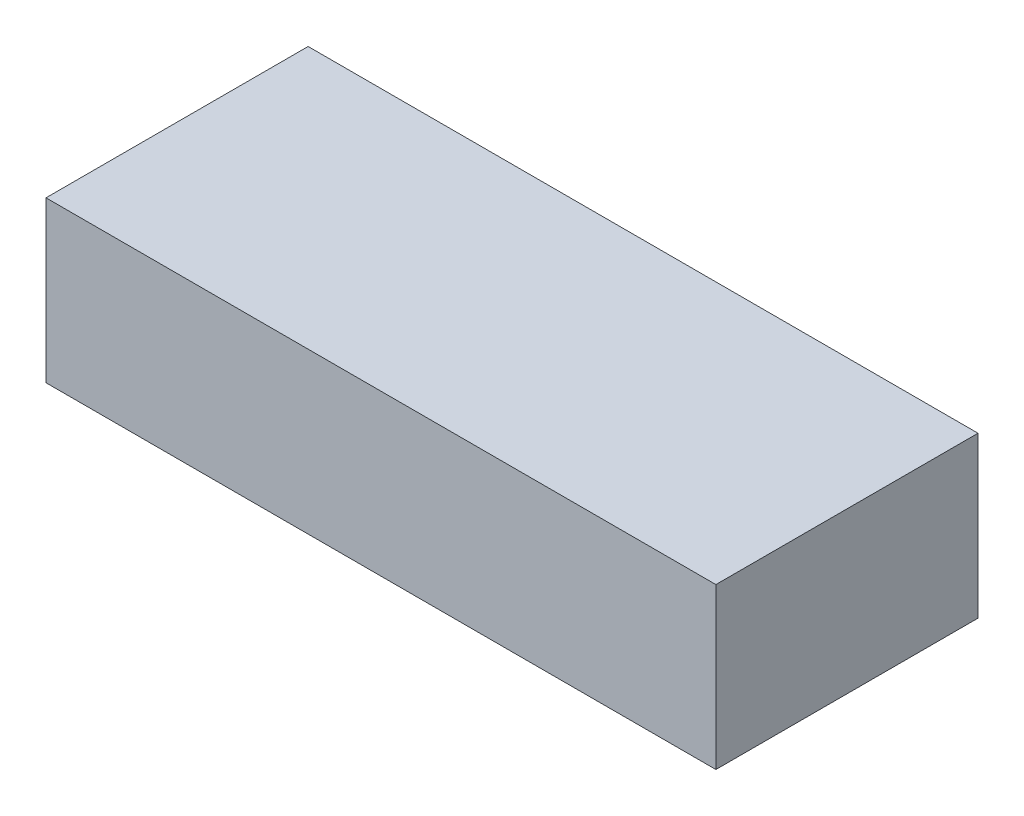
ISO-10303-21;
HEADER;
FILE_DESCRIPTION(('STEP AP214'),'2;1');
FILE_NAME('part.step','',(''),(''),'','','');
FILE_SCHEMA(('AUTOMOTIVE_DESIGN { 1 0 10303 214 1 1 1 1 }'));
ENDSEC;
DATA;
#1=APPLICATION_CONTEXT('core data for automotive mechanical design processes');
#2=APPLICATION_PROTOCOL_DEFINITION('international standard','automotive_design',2000,#1);
#3=PRODUCT_CONTEXT('',#1,'mechanical');
#4=PRODUCT('Part','Part','',(#3));
#5=PRODUCT_RELATED_PRODUCT_CATEGORY('part','',(#4));
#6=PRODUCT_DEFINITION_FORMATION('','',#4);
#7=PRODUCT_DEFINITION_CONTEXT('part definition',#1,'design');
#8=PRODUCT_DEFINITION('design','',#6,#7);
#9=PRODUCT_DEFINITION_SHAPE('','',#8);
#10=(LENGTH_UNIT() NAMED_UNIT(*) SI_UNIT(.MILLI.,.METRE.));
#11=(NAMED_UNIT(*) PLANE_ANGLE_UNIT() SI_UNIT($,.RADIAN.));
#12=(NAMED_UNIT(*) SI_UNIT($,.STERADIAN.) SOLID_ANGLE_UNIT());
#13=UNCERTAINTY_MEASURE_WITH_UNIT(LENGTH_MEASURE(1.E-05),#10,'distance_accuracy_value','');
#14=(GEOMETRIC_REPRESENTATION_CONTEXT(3) GLOBAL_UNCERTAINTY_ASSIGNED_CONTEXT((#13)) GLOBAL_UNIT_ASSIGNED_CONTEXT((#10,
#11,#12)) REPRESENTATION_CONTEXT('',''));
#15=CARTESIAN_POINT('',(0.,0.,0.));
#16=DIRECTION('',(0.,0.,1.));
#17=DIRECTION('',(1.,0.,0.));
#18=AXIS2_PLACEMENT_3D('',#15,#16,#17);
#19=CARTESIAN_POINT('',(6.9,3.3,2.7));
#20=DIRECTION('',(-1.,0.,0.));
#21=DIRECTION('',(0.,0.,1.));
#22=AXIS2_PLACEMENT_3D('',#19,#20,#21);
#23=PLANE('',#22);
#24=DIRECTION('',(0.,0.,-1.));
#25=VECTOR('',#24,1.);
#26=CARTESIAN_POINT('',(6.9,0.,2.7));
#27=LINE('',#26,#25);
#28=CARTESIAN_POINT('',(6.9,0.,2.7));
#29=VERTEX_POINT('',#28);
#30=CARTESIAN_POINT('',(6.9,0.,-2.7));
#31=VERTEX_POINT('',#30);
#32=EDGE_CURVE('E97',#29,#31,#27,.T.);
#33=ORIENTED_EDGE('',*,*,#32,.T.);
#34=DIRECTION('',(0.,-1.,0.));
#35=VECTOR('',#34,1.);
#36=CARTESIAN_POINT('',(6.9,3.3,-2.7));
#37=LINE('',#36,#35);
#38=CARTESIAN_POINT('',(6.9,3.3,-2.7));
#39=VERTEX_POINT('',#38);
#40=EDGE_CURVE('E11',#39,#31,#37,.T.);
#41=ORIENTED_EDGE('',*,*,#40,.F.);
#42=DIRECTION('',(0.,0.,-1.));
#43=VECTOR('',#42,1.);
#44=CARTESIAN_POINT('',(6.9,3.3,2.7));
#45=LINE('',#44,#43);
#46=CARTESIAN_POINT('',(6.9,3.3,2.7));
#47=VERTEX_POINT('',#46);
#48=EDGE_CURVE('E85',#47,#39,#45,.T.);
#49=ORIENTED_EDGE('',*,*,#48,.F.);
#50=DIRECTION('',(0.,-1.,0.));
#51=VECTOR('',#50,1.);
#52=CARTESIAN_POINT('',(6.9,3.3,2.7));
#53=LINE('',#52,#51);
#54=EDGE_CURVE('E93',#47,#29,#53,.T.);
#55=ORIENTED_EDGE('',*,*,#54,.T.);
#56=EDGE_LOOP('',(#33,#41,#49,#55));
#57=FACE_BOUND('',#56,.T.);
#58=ADVANCED_FACE('F34',(#57),#23,.F.);
#59=CARTESIAN_POINT('',(-6.9,3.3,-2.7));
#60=DIRECTION('',(0.,0.,1.));
#61=DIRECTION('',(1.,0.,0.));
#62=AXIS2_PLACEMENT_3D('',#59,#60,#61);
#63=PLANE('',#62);
#64=DIRECTION('',(-1.,0.,0.));
#65=VECTOR('',#64,1.);
#66=CARTESIAN_POINT('',(-6.9,0.,-2.7));
#67=LINE('',#66,#65);
#68=CARTESIAN_POINT('',(-6.9,0.,-2.7));
#69=VERTEX_POINT('',#68);
#70=EDGE_CURVE('E89',#31,#69,#67,.T.);
#71=ORIENTED_EDGE('',*,*,#70,.T.);
#72=DIRECTION('',(0.,-1.,0.));
#73=VECTOR('',#72,1.);
#74=CARTESIAN_POINT('',(-6.9,3.3,-2.7));
#75=LINE('',#74,#73);
#76=CARTESIAN_POINT('',(-6.9,3.3,-2.7));
#77=VERTEX_POINT('',#76);
#78=EDGE_CURVE('E42',#77,#69,#75,.T.);
#79=ORIENTED_EDGE('',*,*,#78,.F.);
#80=DIRECTION('',(-1.,0.,0.));
#81=VECTOR('',#80,1.);
#82=CARTESIAN_POINT('',(-6.9,3.3,-2.7));
#83=LINE('',#82,#81);
#84=EDGE_CURVE('E80',#39,#77,#83,.T.);
#85=ORIENTED_EDGE('',*,*,#84,.F.);
#86=ORIENTED_EDGE('',*,*,#40,.T.);
#87=EDGE_LOOP('',(#71,#79,#85,#86));
#88=FACE_BOUND('',#87,.T.);
#89=ADVANCED_FACE('F88',(#88),#63,.F.);
#90=CARTESIAN_POINT('',(-6.9,3.3,2.7));
#91=DIRECTION('',(1.,0.,0.));
#92=DIRECTION('',(0.,0.,-1.));
#93=AXIS2_PLACEMENT_3D('',#90,#91,#92);
#94=PLANE('',#93);
#95=DIRECTION('',(0.,0.,1.));
#96=VECTOR('',#95,1.);
#97=CARTESIAN_POINT('',(-6.9,0.,2.7));
#98=LINE('',#97,#96);
#99=CARTESIAN_POINT('',(-6.9,0.,2.7));
#100=VERTEX_POINT('',#99);
#101=EDGE_CURVE('E67',#69,#100,#98,.T.);
#102=ORIENTED_EDGE('',*,*,#101,.T.);
#103=DIRECTION('',(0.,-1.,0.));
#104=VECTOR('',#103,1.);
#105=CARTESIAN_POINT('',(-6.9,3.3,2.7));
#106=LINE('',#105,#104);
#107=CARTESIAN_POINT('',(-6.9,3.3,2.7));
#108=VERTEX_POINT('',#107);
#109=EDGE_CURVE('E90',#108,#100,#106,.T.);
#110=ORIENTED_EDGE('',*,*,#109,.F.);
#111=DIRECTION('',(0.,0.,1.));
#112=VECTOR('',#111,1.);
#113=CARTESIAN_POINT('',(-6.9,3.3,2.7));
#114=LINE('',#113,#112);
#115=EDGE_CURVE('E83',#77,#108,#114,.T.);
#116=ORIENTED_EDGE('',*,*,#115,.F.);
#117=ORIENTED_EDGE('',*,*,#78,.T.);
#118=EDGE_LOOP('',(#102,#110,#116,#117));
#119=FACE_BOUND('',#118,.T.);
#120=ADVANCED_FACE('F91',(#119),#94,.F.);
#121=CARTESIAN_POINT('',(-6.9,3.3,2.7));
#122=DIRECTION('',(0.,0.,-1.));
#123=DIRECTION('',(-1.,0.,0.));
#124=AXIS2_PLACEMENT_3D('',#121,#122,#123);
#125=PLANE('',#124);
#126=DIRECTION('',(1.,0.,0.));
#127=VECTOR('',#126,1.);
#128=CARTESIAN_POINT('',(-6.9,0.,2.7));
#129=LINE('',#128,#127);
#130=EDGE_CURVE('E73',#100,#29,#129,.T.);
#131=ORIENTED_EDGE('',*,*,#130,.T.);
#132=ORIENTED_EDGE('',*,*,#54,.F.);
#133=DIRECTION('',(1.,0.,0.));
#134=VECTOR('',#133,1.);
#135=CARTESIAN_POINT('',(-6.9,3.3,2.7));
#136=LINE('',#135,#134);
#137=EDGE_CURVE('E50',#108,#47,#136,.T.);
#138=ORIENTED_EDGE('',*,*,#137,.F.);
#139=ORIENTED_EDGE('',*,*,#109,.T.);
#140=EDGE_LOOP('',(#131,#132,#138,#139));
#141=FACE_BOUND('',#140,.T.);
#142=ADVANCED_FACE('F104',(#141),#125,.F.);
#143=CARTESIAN_POINT('',(0.,3.3,0.));
#144=DIRECTION('',(0.,-1.,0.));
#145=DIRECTION('',(0.,0.,-1.));
#146=AXIS2_PLACEMENT_3D('',#143,#144,#145);
#147=PLANE('',#146);
#148=ORIENTED_EDGE('',*,*,#48,.T.);
#149=ORIENTED_EDGE('',*,*,#84,.T.);
#150=ORIENTED_EDGE('',*,*,#115,.T.);
#151=ORIENTED_EDGE('',*,*,#137,.T.);
#152=EDGE_LOOP('',(#148,#149,#150,#151));
#153=FACE_BOUND('',#152,.T.);
#154=ADVANCED_FACE('F81',(#153),#147,.F.);
#155=CARTESIAN_POINT('',(0.,0.,0.));
#156=DIRECTION('',(0.,-1.,0.));
#157=DIRECTION('',(0.,0.,-1.));
#158=AXIS2_PLACEMENT_3D('',#155,#156,#157);
#159=PLANE('',#158);
#160=ORIENTED_EDGE('',*,*,#32,.F.);
#161=ORIENTED_EDGE('',*,*,#130,.F.);
#162=ORIENTED_EDGE('',*,*,#101,.F.);
#163=ORIENTED_EDGE('',*,*,#70,.F.);
#164=EDGE_LOOP('',(#160,#161,#162,#163));
#165=FACE_BOUND('',#164,.T.);
#166=ADVANCED_FACE('F107',(#165),#159,.T.);
#167=CLOSED_SHELL('',(#58,#89,#120,#142,#154,#166));
#168=MANIFOLD_SOLID_BREP('B2',#167);
#169=ADVANCED_BREP_SHAPE_REPRESENTATION('',(#18,#168),#14);
#170=SHAPE_DEFINITION_REPRESENTATION(#9,#169);
ENDSEC;
END-ISO-10303-21;
